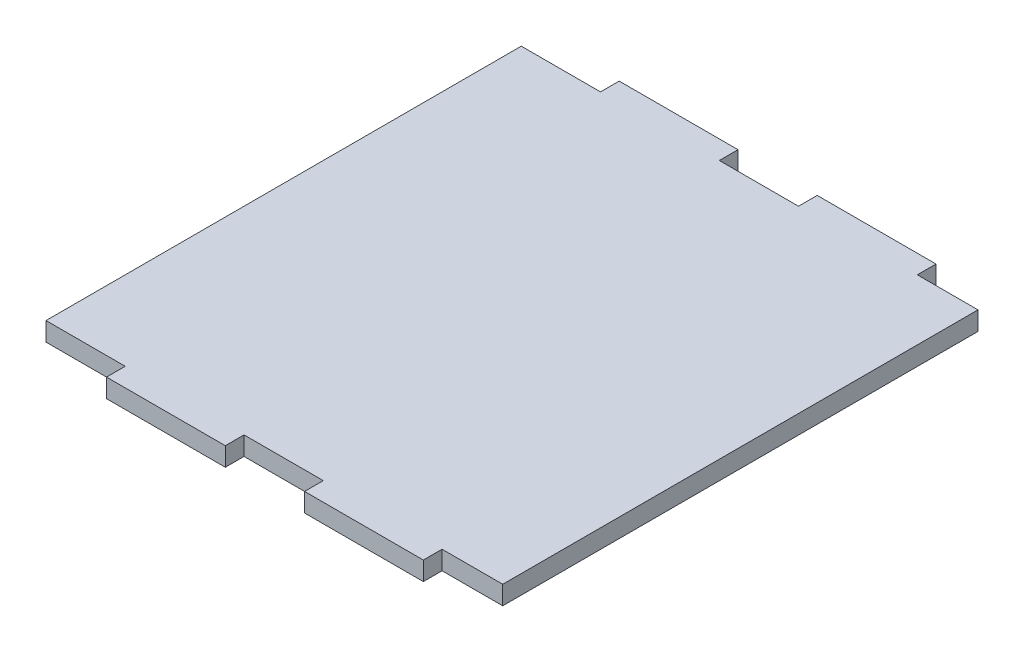
ISO-10303-21;
HEADER;
FILE_DESCRIPTION(('STEP AP214'),'2;1');
FILE_NAME('part.step','',(''),(''),'','','');
FILE_SCHEMA(('AUTOMOTIVE_DESIGN { 1 0 10303 214 1 1 1 1 }'));
ENDSEC;
DATA;
#1=APPLICATION_CONTEXT('core data for automotive mechanical design processes');
#2=APPLICATION_PROTOCOL_DEFINITION('international standard','automotive_design',2000,#1);
#3=PRODUCT_CONTEXT('',#1,'mechanical');
#4=PRODUCT('Part','Part','',(#3));
#5=PRODUCT_RELATED_PRODUCT_CATEGORY('part','',(#4));
#6=PRODUCT_DEFINITION_FORMATION('','',#4);
#7=PRODUCT_DEFINITION_CONTEXT('part definition',#1,'design');
#8=PRODUCT_DEFINITION('design','',#6,#7);
#9=PRODUCT_DEFINITION_SHAPE('','',#8);
#10=(LENGTH_UNIT() NAMED_UNIT(*) SI_UNIT(.MILLI.,.METRE.));
#11=(NAMED_UNIT(*) PLANE_ANGLE_UNIT() SI_UNIT($,.RADIAN.));
#12=(NAMED_UNIT(*) SI_UNIT($,.STERADIAN.) SOLID_ANGLE_UNIT());
#13=UNCERTAINTY_MEASURE_WITH_UNIT(LENGTH_MEASURE(1.E-05),#10,'distance_accuracy_value','');
#14=(GEOMETRIC_REPRESENTATION_CONTEXT(3) GLOBAL_UNCERTAINTY_ASSIGNED_CONTEXT((#13)) GLOBAL_UNIT_ASSIGNED_CONTEXT((#10,
#11,#12)) REPRESENTATION_CONTEXT('',''));
#15=CARTESIAN_POINT('',(0.,0.,0.));
#16=DIRECTION('',(0.,0.,1.));
#17=DIRECTION('',(1.,0.,0.));
#18=AXIS2_PLACEMENT_3D('',#15,#16,#17);
#19=CARTESIAN_POINT('',(25.4,3.,-38.1));
#20=DIRECTION('',(0.,0.,1.));
#21=DIRECTION('',(1.,0.,0.));
#22=AXIS2_PLACEMENT_3D('',#19,#20,#21);
#23=PLANE('',#22);
#24=DIRECTION('',(-1.,0.,0.));
#25=VECTOR('',#24,1.);
#26=CARTESIAN_POINT('',(25.4,0.,-38.1));
#27=LINE('',#26,#25);
#28=CARTESIAN_POINT('',(35.127525216624,0.,-38.1));
#29=VERTEX_POINT('',#28);
#30=CARTESIAN_POINT('',(25.4,0.,-38.1));
#31=VERTEX_POINT('',#30);
#32=EDGE_CURVE('E201',#29,#31,#27,.T.);
#33=ORIENTED_EDGE('',*,*,#32,.T.);
#34=DIRECTION('',(0.,-1.,0.));
#35=VECTOR('',#34,1.);
#36=CARTESIAN_POINT('',(25.4,3.,-38.1));
#37=LINE('',#36,#35);
#38=CARTESIAN_POINT('',(25.4,3.,-38.1));
#39=VERTEX_POINT('',#38);
#40=EDGE_CURVE('E11',#39,#31,#37,.T.);
#41=ORIENTED_EDGE('',*,*,#40,.F.);
#42=DIRECTION('',(-1.,0.,0.));
#43=VECTOR('',#42,1.);
#44=CARTESIAN_POINT('',(25.4,3.,-38.1));
#45=LINE('',#44,#43);
#46=CARTESIAN_POINT('',(35.127525216624,3.,-38.1));
#47=VERTEX_POINT('',#46);
#48=EDGE_CURVE('E239',#47,#39,#45,.T.);
#49=ORIENTED_EDGE('',*,*,#48,.F.);
#50=DIRECTION('',(0.,-1.,0.));
#51=VECTOR('',#50,1.);
#52=CARTESIAN_POINT('',(35.127525216624,3.,-38.1));
#53=LINE('',#52,#51);
#54=EDGE_CURVE('E197',#47,#29,#53,.T.);
#55=ORIENTED_EDGE('',*,*,#54,.T.);
#56=EDGE_LOOP('',(#33,#41,#49,#55));
#57=FACE_BOUND('',#56,.T.);
#58=ADVANCED_FACE('F33',(#57),#23,.F.);
#59=CARTESIAN_POINT('',(25.4,3.,-38.1));
#60=DIRECTION('',(-1.,0.,0.));
#61=DIRECTION('',(0.,0.,1.));
#62=AXIS2_PLACEMENT_3D('',#59,#60,#61);
#63=PLANE('',#62);
#64=DIRECTION('',(0.,0.,-1.));
#65=VECTOR('',#64,1.);
#66=CARTESIAN_POINT('',(25.4,0.,-38.1));
#67=LINE('',#66,#65);
#68=CARTESIAN_POINT('',(25.4,0.,-41.1));
#69=VERTEX_POINT('',#68);
#70=EDGE_CURVE('E204',#31,#69,#67,.T.);
#71=ORIENTED_EDGE('',*,*,#70,.T.);
#72=DIRECTION('',(0.,-1.,0.));
#73=VECTOR('',#72,1.);
#74=CARTESIAN_POINT('',(25.4,3.,-41.1));
#75=LINE('',#74,#73);
#76=CARTESIAN_POINT('',(25.4,3.,-41.1));
#77=VERTEX_POINT('',#76);
#78=EDGE_CURVE('E41',#77,#69,#75,.T.);
#79=ORIENTED_EDGE('',*,*,#78,.F.);
#80=DIRECTION('',(0.,0.,-1.));
#81=VECTOR('',#80,1.);
#82=CARTESIAN_POINT('',(25.4,3.,-38.1));
#83=LINE('',#82,#81);
#84=EDGE_CURVE('E128',#39,#77,#83,.T.);
#85=ORIENTED_EDGE('',*,*,#84,.F.);
#86=ORIENTED_EDGE('',*,*,#40,.T.);
#87=EDGE_LOOP('',(#71,#79,#85,#86));
#88=FACE_BOUND('',#87,.T.);
#89=ADVANCED_FACE('F357',(#88),#63,.F.);
#90=CARTESIAN_POINT('',(6.35,3.,-41.1));
#91=DIRECTION('',(0.,0.,1.));
#92=DIRECTION('',(1.,0.,0.));
#93=AXIS2_PLACEMENT_3D('',#90,#91,#92);
#94=PLANE('',#93);
#95=DIRECTION('',(-1.,0.,0.));
#96=VECTOR('',#95,1.);
#97=CARTESIAN_POINT('',(6.35,0.,-41.1));
#98=LINE('',#97,#96);
#99=CARTESIAN_POINT('',(6.35,0.,-41.1));
#100=VERTEX_POINT('',#99);
#101=EDGE_CURVE('E206',#69,#100,#98,.T.);
#102=ORIENTED_EDGE('',*,*,#101,.T.);
#103=DIRECTION('',(0.,-1.,0.));
#104=VECTOR('',#103,1.);
#105=CARTESIAN_POINT('',(6.35,3.,-41.1));
#106=LINE('',#105,#104);
#107=CARTESIAN_POINT('',(6.35,3.,-41.1));
#108=VERTEX_POINT('',#107);
#109=EDGE_CURVE('E282',#108,#100,#106,.T.);
#110=ORIENTED_EDGE('',*,*,#109,.F.);
#111=DIRECTION('',(-1.,0.,0.));
#112=VECTOR('',#111,1.);
#113=CARTESIAN_POINT('',(6.35,3.,-41.1));
#114=LINE('',#113,#112);
#115=EDGE_CURVE('E290',#77,#108,#114,.T.);
#116=ORIENTED_EDGE('',*,*,#115,.F.);
#117=ORIENTED_EDGE('',*,*,#78,.T.);
#118=EDGE_LOOP('',(#102,#110,#116,#117));
#119=FACE_BOUND('',#118,.T.);
#120=ADVANCED_FACE('F288',(#119),#94,.F.);
#121=CARTESIAN_POINT('',(6.35,3.,-38.1));
#122=DIRECTION('',(1.,0.,0.));
#123=DIRECTION('',(0.,0.,-1.));
#124=AXIS2_PLACEMENT_3D('',#121,#122,#123);
#125=PLANE('',#124);
#126=DIRECTION('',(0.,0.,1.));
#127=VECTOR('',#126,1.);
#128=CARTESIAN_POINT('',(6.35,0.,-38.1));
#129=LINE('',#128,#127);
#130=CARTESIAN_POINT('',(6.35,0.,-38.1));
#131=VERTEX_POINT('',#130);
#132=EDGE_CURVE('E208',#100,#131,#129,.T.);
#133=ORIENTED_EDGE('',*,*,#132,.T.);
#134=DIRECTION('',(0.,-1.,0.));
#135=VECTOR('',#134,1.);
#136=CARTESIAN_POINT('',(6.35,3.,-38.1));
#137=LINE('',#136,#135);
#138=CARTESIAN_POINT('',(6.35,3.,-38.1));
#139=VERTEX_POINT('',#138);
#140=EDGE_CURVE('E279',#139,#131,#137,.T.);
#141=ORIENTED_EDGE('',*,*,#140,.F.);
#142=DIRECTION('',(0.,0.,1.));
#143=VECTOR('',#142,1.);
#144=CARTESIAN_POINT('',(6.35,3.,-38.1));
#145=LINE('',#144,#143);
#146=EDGE_CURVE('E308',#108,#139,#145,.T.);
#147=ORIENTED_EDGE('',*,*,#146,.F.);
#148=ORIENTED_EDGE('',*,*,#109,.T.);
#149=EDGE_LOOP('',(#133,#141,#147,#148));
#150=FACE_BOUND('',#149,.T.);
#151=ADVANCED_FACE('F299',(#150),#125,.F.);
#152=CARTESIAN_POINT('',(-6.35,3.,-38.1));
#153=DIRECTION('',(0.,0.,1.));
#154=DIRECTION('',(1.,0.,0.));
#155=AXIS2_PLACEMENT_3D('',#152,#153,#154);
#156=PLANE('',#155);
#157=DIRECTION('',(-1.,0.,0.));
#158=VECTOR('',#157,1.);
#159=CARTESIAN_POINT('',(-6.35,0.,-38.1));
#160=LINE('',#159,#158);
#161=CARTESIAN_POINT('',(-6.35,0.,-38.1));
#162=VERTEX_POINT('',#161);
#163=EDGE_CURVE('E210',#131,#162,#160,.T.);
#164=ORIENTED_EDGE('',*,*,#163,.T.);
#165=DIRECTION('',(0.,-1.,0.));
#166=VECTOR('',#165,1.);
#167=CARTESIAN_POINT('',(-6.35,3.,-38.1));
#168=LINE('',#167,#166);
#169=CARTESIAN_POINT('',(-6.35,3.,-38.1));
#170=VERTEX_POINT('',#169);
#171=EDGE_CURVE('E276',#170,#162,#168,.T.);
#172=ORIENTED_EDGE('',*,*,#171,.F.);
#173=DIRECTION('',(-1.,0.,0.));
#174=VECTOR('',#173,1.);
#175=CARTESIAN_POINT('',(-6.35,3.,-38.1));
#176=LINE('',#175,#174);
#177=EDGE_CURVE('E305',#139,#170,#176,.T.);
#178=ORIENTED_EDGE('',*,*,#177,.F.);
#179=ORIENTED_EDGE('',*,*,#140,.T.);
#180=EDGE_LOOP('',(#164,#172,#178,#179));
#181=FACE_BOUND('',#180,.T.);
#182=ADVANCED_FACE('F303',(#181),#156,.F.);
#183=CARTESIAN_POINT('',(-6.35,3.,-38.1));
#184=DIRECTION('',(-1.,0.,0.));
#185=DIRECTION('',(0.,0.,1.));
#186=AXIS2_PLACEMENT_3D('',#183,#184,#185);
#187=PLANE('',#186);
#188=DIRECTION('',(0.,0.,-1.));
#189=VECTOR('',#188,1.);
#190=CARTESIAN_POINT('',(-6.35,0.,-38.1));
#191=LINE('',#190,#189);
#192=CARTESIAN_POINT('',(-6.35,0.,-41.1));
#193=VERTEX_POINT('',#192);
#194=EDGE_CURVE('E212',#162,#193,#191,.T.);
#195=ORIENTED_EDGE('',*,*,#194,.T.);
#196=DIRECTION('',(0.,-1.,0.));
#197=VECTOR('',#196,1.);
#198=CARTESIAN_POINT('',(-6.35,3.,-41.1));
#199=LINE('',#198,#197);
#200=CARTESIAN_POINT('',(-6.35,3.,-41.1));
#201=VERTEX_POINT('',#200);
#202=EDGE_CURVE('E273',#201,#193,#199,.T.);
#203=ORIENTED_EDGE('',*,*,#202,.F.);
#204=DIRECTION('',(0.,0.,-1.));
#205=VECTOR('',#204,1.);
#206=CARTESIAN_POINT('',(-6.35,3.,-38.1));
#207=LINE('',#206,#205);
#208=EDGE_CURVE('E307',#170,#201,#207,.T.);
#209=ORIENTED_EDGE('',*,*,#208,.F.);
#210=ORIENTED_EDGE('',*,*,#171,.T.);
#211=EDGE_LOOP('',(#195,#203,#209,#210));
#212=FACE_BOUND('',#211,.T.);
#213=ADVANCED_FACE('F370',(#212),#187,.F.);
#214=CARTESIAN_POINT('',(-25.4,3.,-41.1));
#215=DIRECTION('',(0.,0.,1.));
#216=DIRECTION('',(1.,0.,0.));
#217=AXIS2_PLACEMENT_3D('',#214,#215,#216);
#218=PLANE('',#217);
#219=DIRECTION('',(-1.,0.,0.));
#220=VECTOR('',#219,1.);
#221=CARTESIAN_POINT('',(-25.4,0.,-41.1));
#222=LINE('',#221,#220);
#223=CARTESIAN_POINT('',(-25.4,0.,-41.1));
#224=VERTEX_POINT('',#223);
#225=EDGE_CURVE('E214',#193,#224,#222,.T.);
#226=ORIENTED_EDGE('',*,*,#225,.T.);
#227=DIRECTION('',(0.,-1.,0.));
#228=VECTOR('',#227,1.);
#229=CARTESIAN_POINT('',(-25.4,3.,-41.1));
#230=LINE('',#229,#228);
#231=CARTESIAN_POINT('',(-25.4,3.,-41.1));
#232=VERTEX_POINT('',#231);
#233=EDGE_CURVE('E270',#232,#224,#230,.T.);
#234=ORIENTED_EDGE('',*,*,#233,.F.);
#235=DIRECTION('',(-1.,0.,0.));
#236=VECTOR('',#235,1.);
#237=CARTESIAN_POINT('',(-25.4,3.,-41.1));
#238=LINE('',#237,#236);
#239=EDGE_CURVE('E310',#201,#232,#238,.T.);
#240=ORIENTED_EDGE('',*,*,#239,.F.);
#241=ORIENTED_EDGE('',*,*,#202,.T.);
#242=EDGE_LOOP('',(#226,#234,#240,#241));
#243=FACE_BOUND('',#242,.T.);
#244=ADVANCED_FACE('F373',(#243),#218,.F.);
#245=CARTESIAN_POINT('',(-25.4,3.,-38.1));
#246=DIRECTION('',(1.,0.,0.));
#247=DIRECTION('',(0.,0.,-1.));
#248=AXIS2_PLACEMENT_3D('',#245,#246,#247);
#249=PLANE('',#248);
#250=DIRECTION('',(0.,0.,1.));
#251=VECTOR('',#250,1.);
#252=CARTESIAN_POINT('',(-25.4,0.,-38.1));
#253=LINE('',#252,#251);
#254=CARTESIAN_POINT('',(-25.4,0.,-38.1));
#255=VERTEX_POINT('',#254);
#256=EDGE_CURVE('E216',#224,#255,#253,.T.);
#257=ORIENTED_EDGE('',*,*,#256,.T.);
#258=DIRECTION('',(0.,-1.,0.));
#259=VECTOR('',#258,1.);
#260=CARTESIAN_POINT('',(-25.4,3.,-38.1));
#261=LINE('',#260,#259);
#262=CARTESIAN_POINT('',(-25.4,3.,-38.1));
#263=VERTEX_POINT('',#262);
#264=EDGE_CURVE('E267',#263,#255,#261,.T.);
#265=ORIENTED_EDGE('',*,*,#264,.F.);
#266=DIRECTION('',(0.,0.,1.));
#267=VECTOR('',#266,1.);
#268=CARTESIAN_POINT('',(-25.4,3.,-38.1));
#269=LINE('',#268,#267);
#270=EDGE_CURVE('E316',#232,#263,#269,.T.);
#271=ORIENTED_EDGE('',*,*,#270,.F.);
#272=ORIENTED_EDGE('',*,*,#233,.T.);
#273=EDGE_LOOP('',(#257,#265,#271,#272));
#274=FACE_BOUND('',#273,.T.);
#275=ADVANCED_FACE('F377',(#274),#249,.F.);
#276=CARTESIAN_POINT('',(-38.1,3.,-38.1));
#277=DIRECTION('',(0.,0.,1.));
#278=DIRECTION('',(1.,0.,0.));
#279=AXIS2_PLACEMENT_3D('',#276,#277,#278);
#280=PLANE('',#279);
#281=DIRECTION('',(-1.,0.,0.));
#282=VECTOR('',#281,1.);
#283=CARTESIAN_POINT('',(-38.1,0.,-38.1));
#284=LINE('',#283,#282);
#285=CARTESIAN_POINT('',(-38.1,0.,-38.1));
#286=VERTEX_POINT('',#285);
#287=EDGE_CURVE('E218',#255,#286,#284,.T.);
#288=ORIENTED_EDGE('',*,*,#287,.T.);
#289=DIRECTION('',(0.,-1.,0.));
#290=VECTOR('',#289,1.);
#291=CARTESIAN_POINT('',(-38.1,3.,-38.1));
#292=LINE('',#291,#290);
#293=CARTESIAN_POINT('',(-38.1,3.,-38.1));
#294=VERTEX_POINT('',#293);
#295=EDGE_CURVE('E264',#294,#286,#292,.T.);
#296=ORIENTED_EDGE('',*,*,#295,.F.);
#297=DIRECTION('',(-1.,0.,0.));
#298=VECTOR('',#297,1.);
#299=CARTESIAN_POINT('',(-38.1,3.,-38.1));
#300=LINE('',#299,#298);
#301=EDGE_CURVE('E318',#263,#294,#300,.T.);
#302=ORIENTED_EDGE('',*,*,#301,.F.);
#303=ORIENTED_EDGE('',*,*,#264,.T.);
#304=EDGE_LOOP('',(#288,#296,#302,#303));
#305=FACE_BOUND('',#304,.T.);
#306=ADVANCED_FACE('F381',(#305),#280,.F.);
#307=CARTESIAN_POINT('',(-38.1,3.,-38.1));
#308=DIRECTION('',(1.,0.,0.));
#309=DIRECTION('',(0.,0.,-1.));
#310=AXIS2_PLACEMENT_3D('',#307,#308,#309);
#311=PLANE('',#310);
#312=DIRECTION('',(0.,0.,1.));
#313=VECTOR('',#312,1.);
#314=CARTESIAN_POINT('',(-38.1,0.,-38.1));
#315=LINE('',#314,#313);
#316=CARTESIAN_POINT('',(-38.1,0.,38.1));
#317=VERTEX_POINT('',#316);
#318=EDGE_CURVE('E220',#286,#317,#315,.T.);
#319=ORIENTED_EDGE('',*,*,#318,.T.);
#320=DIRECTION('',(0.,-1.,0.));
#321=VECTOR('',#320,1.);
#322=CARTESIAN_POINT('',(-38.1,3.,38.1));
#323=LINE('',#322,#321);
#324=CARTESIAN_POINT('',(-38.1,3.,38.1));
#325=VERTEX_POINT('',#324);
#326=EDGE_CURVE('E261',#325,#317,#323,.T.);
#327=ORIENTED_EDGE('',*,*,#326,.F.);
#328=DIRECTION('',(0.,0.,1.));
#329=VECTOR('',#328,1.);
#330=CARTESIAN_POINT('',(-38.1,3.,-38.1));
#331=LINE('',#330,#329);
#332=EDGE_CURVE('E320',#294,#325,#331,.T.);
#333=ORIENTED_EDGE('',*,*,#332,.F.);
#334=ORIENTED_EDGE('',*,*,#295,.T.);
#335=EDGE_LOOP('',(#319,#327,#333,#334));
#336=FACE_BOUND('',#335,.T.);
#337=ADVANCED_FACE('F385',(#336),#311,.F.);
#338=CARTESIAN_POINT('',(-38.1,3.,38.1));
#339=DIRECTION('',(0.,0.,-1.));
#340=DIRECTION('',(-1.,0.,0.));
#341=AXIS2_PLACEMENT_3D('',#338,#339,#340);
#342=PLANE('',#341);
#343=DIRECTION('',(1.,0.,0.));
#344=VECTOR('',#343,1.);
#345=CARTESIAN_POINT('',(-38.1,0.,38.1));
#346=LINE('',#345,#344);
#347=CARTESIAN_POINT('',(-25.4,0.,38.1));
#348=VERTEX_POINT('',#347);
#349=EDGE_CURVE('E222',#317,#348,#346,.T.);
#350=ORIENTED_EDGE('',*,*,#349,.T.);
#351=DIRECTION('',(0.,-1.,0.));
#352=VECTOR('',#351,1.);
#353=CARTESIAN_POINT('',(-25.4,3.,38.1));
#354=LINE('',#353,#352);
#355=CARTESIAN_POINT('',(-25.4,3.,38.1));
#356=VERTEX_POINT('',#355);
#357=EDGE_CURVE('E258',#356,#348,#354,.T.);
#358=ORIENTED_EDGE('',*,*,#357,.F.);
#359=DIRECTION('',(1.,0.,0.));
#360=VECTOR('',#359,1.);
#361=CARTESIAN_POINT('',(-38.1,3.,38.1));
#362=LINE('',#361,#360);
#363=EDGE_CURVE('E322',#325,#356,#362,.T.);
#364=ORIENTED_EDGE('',*,*,#363,.F.);
#365=ORIENTED_EDGE('',*,*,#326,.T.);
#366=EDGE_LOOP('',(#350,#358,#364,#365));
#367=FACE_BOUND('',#366,.T.);
#368=ADVANCED_FACE('F389',(#367),#342,.F.);
#369=CARTESIAN_POINT('',(-25.4,3.,38.1));
#370=DIRECTION('',(1.,0.,0.));
#371=DIRECTION('',(0.,0.,-1.));
#372=AXIS2_PLACEMENT_3D('',#369,#370,#371);
#373=PLANE('',#372);
#374=DIRECTION('',(0.,0.,1.));
#375=VECTOR('',#374,1.);
#376=CARTESIAN_POINT('',(-25.4,0.,38.1));
#377=LINE('',#376,#375);
#378=CARTESIAN_POINT('',(-25.4,0.,41.1));
#379=VERTEX_POINT('',#378);
#380=EDGE_CURVE('E224',#348,#379,#377,.T.);
#381=ORIENTED_EDGE('',*,*,#380,.T.);
#382=DIRECTION('',(0.,-1.,0.));
#383=VECTOR('',#382,1.);
#384=CARTESIAN_POINT('',(-25.4,3.,41.1));
#385=LINE('',#384,#383);
#386=CARTESIAN_POINT('',(-25.4,3.,41.1));
#387=VERTEX_POINT('',#386);
#388=EDGE_CURVE('E255',#387,#379,#385,.T.);
#389=ORIENTED_EDGE('',*,*,#388,.F.);
#390=DIRECTION('',(0.,0.,1.));
#391=VECTOR('',#390,1.);
#392=CARTESIAN_POINT('',(-25.4,3.,38.1));
#393=LINE('',#392,#391);
#394=EDGE_CURVE('E324',#356,#387,#393,.T.);
#395=ORIENTED_EDGE('',*,*,#394,.F.);
#396=ORIENTED_EDGE('',*,*,#357,.T.);
#397=EDGE_LOOP('',(#381,#389,#395,#396));
#398=FACE_BOUND('',#397,.T.);
#399=ADVANCED_FACE('F393',(#398),#373,.F.);
#400=CARTESIAN_POINT('',(-25.4,3.,41.1));
#401=DIRECTION('',(0.,0.,-1.));
#402=DIRECTION('',(-1.,0.,0.));
#403=AXIS2_PLACEMENT_3D('',#400,#401,#402);
#404=PLANE('',#403);
#405=DIRECTION('',(1.,0.,0.));
#406=VECTOR('',#405,1.);
#407=CARTESIAN_POINT('',(-25.4,0.,41.1));
#408=LINE('',#407,#406);
#409=CARTESIAN_POINT('',(-6.35,0.,41.1));
#410=VERTEX_POINT('',#409);
#411=EDGE_CURVE('E226',#379,#410,#408,.T.);
#412=ORIENTED_EDGE('',*,*,#411,.T.);
#413=DIRECTION('',(0.,-1.,0.));
#414=VECTOR('',#413,1.);
#415=CARTESIAN_POINT('',(-6.35,3.,41.1));
#416=LINE('',#415,#414);
#417=CARTESIAN_POINT('',(-6.35,3.,41.1));
#418=VERTEX_POINT('',#417);
#419=EDGE_CURVE('E252',#418,#410,#416,.T.);
#420=ORIENTED_EDGE('',*,*,#419,.F.);
#421=DIRECTION('',(1.,0.,0.));
#422=VECTOR('',#421,1.);
#423=CARTESIAN_POINT('',(-25.4,3.,41.1));
#424=LINE('',#423,#422);
#425=EDGE_CURVE('E326',#387,#418,#424,.T.);
#426=ORIENTED_EDGE('',*,*,#425,.F.);
#427=ORIENTED_EDGE('',*,*,#388,.T.);
#428=EDGE_LOOP('',(#412,#420,#426,#427));
#429=FACE_BOUND('',#428,.T.);
#430=ADVANCED_FACE('F397',(#429),#404,.F.);
#431=CARTESIAN_POINT('',(-6.35,3.,38.1));
#432=DIRECTION('',(-1.,0.,0.));
#433=DIRECTION('',(0.,0.,1.));
#434=AXIS2_PLACEMENT_3D('',#431,#432,#433);
#435=PLANE('',#434);
#436=DIRECTION('',(0.,0.,-1.));
#437=VECTOR('',#436,1.);
#438=CARTESIAN_POINT('',(-6.35,0.,38.1));
#439=LINE('',#438,#437);
#440=CARTESIAN_POINT('',(-6.35,0.,38.1));
#441=VERTEX_POINT('',#440);
#442=EDGE_CURVE('E228',#410,#441,#439,.T.);
#443=ORIENTED_EDGE('',*,*,#442,.T.);
#444=DIRECTION('',(0.,-1.,0.));
#445=VECTOR('',#444,1.);
#446=CARTESIAN_POINT('',(-6.35,3.,38.1));
#447=LINE('',#446,#445);
#448=CARTESIAN_POINT('',(-6.35,3.,38.1));
#449=VERTEX_POINT('',#448);
#450=EDGE_CURVE('E249',#449,#441,#447,.T.);
#451=ORIENTED_EDGE('',*,*,#450,.F.);
#452=DIRECTION('',(0.,0.,-1.));
#453=VECTOR('',#452,1.);
#454=CARTESIAN_POINT('',(-6.35,3.,38.1));
#455=LINE('',#454,#453);
#456=EDGE_CURVE('E328',#418,#449,#455,.T.);
#457=ORIENTED_EDGE('',*,*,#456,.F.);
#458=ORIENTED_EDGE('',*,*,#419,.T.);
#459=EDGE_LOOP('',(#443,#451,#457,#458));
#460=FACE_BOUND('',#459,.T.);
#461=ADVANCED_FACE('F401',(#460),#435,.F.);
#462=CARTESIAN_POINT('',(-6.35,3.,38.1));
#463=DIRECTION('',(0.,0.,-1.));
#464=DIRECTION('',(-1.,0.,0.));
#465=AXIS2_PLACEMENT_3D('',#462,#463,#464);
#466=PLANE('',#465);
#467=DIRECTION('',(1.,0.,0.));
#468=VECTOR('',#467,1.);
#469=CARTESIAN_POINT('',(-6.35,0.,38.1));
#470=LINE('',#469,#468);
#471=CARTESIAN_POINT('',(6.35,0.,38.1));
#472=VERTEX_POINT('',#471);
#473=EDGE_CURVE('E230',#441,#472,#470,.T.);
#474=ORIENTED_EDGE('',*,*,#473,.T.);
#475=DIRECTION('',(0.,-1.,0.));
#476=VECTOR('',#475,1.);
#477=CARTESIAN_POINT('',(6.35,3.,38.1));
#478=LINE('',#477,#476);
#479=CARTESIAN_POINT('',(6.35,3.,38.1));
#480=VERTEX_POINT('',#479);
#481=EDGE_CURVE('E246',#480,#472,#478,.T.);
#482=ORIENTED_EDGE('',*,*,#481,.F.);
#483=DIRECTION('',(1.,0.,0.));
#484=VECTOR('',#483,1.);
#485=CARTESIAN_POINT('',(-6.35,3.,38.1));
#486=LINE('',#485,#484);
#487=EDGE_CURVE('E330',#449,#480,#486,.T.);
#488=ORIENTED_EDGE('',*,*,#487,.F.);
#489=ORIENTED_EDGE('',*,*,#450,.T.);
#490=EDGE_LOOP('',(#474,#482,#488,#489));
#491=FACE_BOUND('',#490,.T.);
#492=ADVANCED_FACE('F405',(#491),#466,.F.);
#493=CARTESIAN_POINT('',(6.35,3.,38.1));
#494=DIRECTION('',(1.,0.,0.));
#495=DIRECTION('',(0.,0.,-1.));
#496=AXIS2_PLACEMENT_3D('',#493,#494,#495);
#497=PLANE('',#496);
#498=DIRECTION('',(0.,0.,1.));
#499=VECTOR('',#498,1.);
#500=CARTESIAN_POINT('',(6.35,0.,38.1));
#501=LINE('',#500,#499);
#502=CARTESIAN_POINT('',(6.35,0.,41.1));
#503=VERTEX_POINT('',#502);
#504=EDGE_CURVE('E232',#472,#503,#501,.T.);
#505=ORIENTED_EDGE('',*,*,#504,.T.);
#506=DIRECTION('',(0.,-1.,0.));
#507=VECTOR('',#506,1.);
#508=CARTESIAN_POINT('',(6.35,3.,41.1));
#509=LINE('',#508,#507);
#510=CARTESIAN_POINT('',(6.35,3.,41.1));
#511=VERTEX_POINT('',#510);
#512=EDGE_CURVE('E243',#511,#503,#509,.T.);
#513=ORIENTED_EDGE('',*,*,#512,.F.);
#514=DIRECTION('',(0.,0.,1.));
#515=VECTOR('',#514,1.);
#516=CARTESIAN_POINT('',(6.35,3.,38.1));
#517=LINE('',#516,#515);
#518=EDGE_CURVE('E332',#480,#511,#517,.T.);
#519=ORIENTED_EDGE('',*,*,#518,.F.);
#520=ORIENTED_EDGE('',*,*,#481,.T.);
#521=EDGE_LOOP('',(#505,#513,#519,#520));
#522=FACE_BOUND('',#521,.T.);
#523=ADVANCED_FACE('F338',(#522),#497,.F.);
#524=CARTESIAN_POINT('',(6.35,3.,41.1));
#525=DIRECTION('',(0.,0.,-1.));
#526=DIRECTION('',(-1.,0.,0.));
#527=AXIS2_PLACEMENT_3D('',#524,#525,#526);
#528=PLANE('',#527);
#529=DIRECTION('',(1.,0.,0.));
#530=VECTOR('',#529,1.);
#531=CARTESIAN_POINT('',(6.35,0.,41.1));
#532=LINE('',#531,#530);
#533=CARTESIAN_POINT('',(25.4,0.,41.1));
#534=VERTEX_POINT('',#533);
#535=EDGE_CURVE('E234',#503,#534,#532,.T.);
#536=ORIENTED_EDGE('',*,*,#535,.T.);
#537=DIRECTION('',(0.,-1.,0.));
#538=VECTOR('',#537,1.);
#539=CARTESIAN_POINT('',(25.4,3.,41.1));
#540=LINE('',#539,#538);
#541=CARTESIAN_POINT('',(25.4,3.,41.1));
#542=VERTEX_POINT('',#541);
#543=EDGE_CURVE('E192',#542,#534,#540,.T.);
#544=ORIENTED_EDGE('',*,*,#543,.F.);
#545=DIRECTION('',(1.,0.,0.));
#546=VECTOR('',#545,1.);
#547=CARTESIAN_POINT('',(6.35,3.,41.1));
#548=LINE('',#547,#546);
#549=EDGE_CURVE('E183',#511,#542,#548,.T.);
#550=ORIENTED_EDGE('',*,*,#549,.F.);
#551=ORIENTED_EDGE('',*,*,#512,.T.);
#552=EDGE_LOOP('',(#536,#544,#550,#551));
#553=FACE_BOUND('',#552,.T.);
#554=ADVANCED_FACE('F342',(#553),#528,.F.);
#555=CARTESIAN_POINT('',(25.4,3.,38.1));
#556=DIRECTION('',(-1.,0.,0.));
#557=DIRECTION('',(0.,0.,1.));
#558=AXIS2_PLACEMENT_3D('',#555,#556,#557);
#559=PLANE('',#558);
#560=DIRECTION('',(0.,0.,-1.));
#561=VECTOR('',#560,1.);
#562=CARTESIAN_POINT('',(25.4,0.,38.1));
#563=LINE('',#562,#561);
#564=CARTESIAN_POINT('',(25.4,0.,38.1));
#565=VERTEX_POINT('',#564);
#566=EDGE_CURVE('E191',#534,#565,#563,.T.);
#567=ORIENTED_EDGE('',*,*,#566,.T.);
#568=DIRECTION('',(0.,-1.,0.));
#569=VECTOR('',#568,1.);
#570=CARTESIAN_POINT('',(25.4,3.,38.1));
#571=LINE('',#570,#569);
#572=CARTESIAN_POINT('',(25.4,3.,38.1));
#573=VERTEX_POINT('',#572);
#574=EDGE_CURVE('E188',#573,#565,#571,.T.);
#575=ORIENTED_EDGE('',*,*,#574,.F.);
#576=DIRECTION('',(0.,0.,-1.));
#577=VECTOR('',#576,1.);
#578=CARTESIAN_POINT('',(25.4,3.,38.1));
#579=LINE('',#578,#577);
#580=EDGE_CURVE('E177',#542,#573,#579,.T.);
#581=ORIENTED_EDGE('',*,*,#580,.F.);
#582=ORIENTED_EDGE('',*,*,#543,.T.);
#583=EDGE_LOOP('',(#567,#575,#581,#582));
#584=FACE_BOUND('',#583,.T.);
#585=ADVANCED_FACE('F189',(#584),#559,.F.);
#586=CARTESIAN_POINT('',(25.4,3.,38.1));
#587=DIRECTION('',(0.,0.,-1.));
#588=DIRECTION('',(-1.,0.,0.));
#589=AXIS2_PLACEMENT_3D('',#586,#587,#588);
#590=PLANE('',#589);
#591=DIRECTION('',(1.,0.,0.));
#592=VECTOR('',#591,1.);
#593=CARTESIAN_POINT('',(25.4,0.,38.1));
#594=LINE('',#593,#592);
#595=CARTESIAN_POINT('',(35.127525216624,0.,38.1));
#596=VERTEX_POINT('',#595);
#597=EDGE_CURVE('E114',#565,#596,#594,.T.);
#598=ORIENTED_EDGE('',*,*,#597,.T.);
#599=DIRECTION('',(0.,-1.,0.));
#600=VECTOR('',#599,1.);
#601=CARTESIAN_POINT('',(35.127525216624,3.,38.1));
#602=LINE('',#601,#600);
#603=CARTESIAN_POINT('',(35.127525216624,3.,38.1));
#604=VERTEX_POINT('',#603);
#605=EDGE_CURVE('E193',#604,#596,#602,.T.);
#606=ORIENTED_EDGE('',*,*,#605,.F.);
#607=DIRECTION('',(1.,0.,0.));
#608=VECTOR('',#607,1.);
#609=CARTESIAN_POINT('',(25.4,3.,38.1));
#610=LINE('',#609,#608);
#611=EDGE_CURVE('E181',#573,#604,#610,.T.);
#612=ORIENTED_EDGE('',*,*,#611,.F.);
#613=ORIENTED_EDGE('',*,*,#574,.T.);
#614=EDGE_LOOP('',(#598,#606,#612,#613));
#615=FACE_BOUND('',#614,.T.);
#616=ADVANCED_FACE('F195',(#615),#590,.F.);
#617=CARTESIAN_POINT('',(35.127525216624,3.,-38.1));
#618=DIRECTION('',(-1.,0.,0.));
#619=DIRECTION('',(0.,0.,1.));
#620=AXIS2_PLACEMENT_3D('',#617,#618,#619);
#621=PLANE('',#620);
#622=DIRECTION('',(0.,0.,-1.));
#623=VECTOR('',#622,1.);
#624=CARTESIAN_POINT('',(35.127525216624,0.,-38.1));
#625=LINE('',#624,#623);
#626=EDGE_CURVE('E120',#596,#29,#625,.T.);
#627=ORIENTED_EDGE('',*,*,#626,.T.);
#628=ORIENTED_EDGE('',*,*,#54,.F.);
#629=DIRECTION('',(0.,0.,-1.));
#630=VECTOR('',#629,1.);
#631=CARTESIAN_POINT('',(35.127525216624,3.,-38.1));
#632=LINE('',#631,#630);
#633=EDGE_CURVE('E49',#604,#47,#632,.T.);
#634=ORIENTED_EDGE('',*,*,#633,.F.);
#635=ORIENTED_EDGE('',*,*,#605,.T.);
#636=EDGE_LOOP('',(#627,#628,#634,#635));
#637=FACE_BOUND('',#636,.T.);
#638=ADVANCED_FACE('F346',(#637),#621,.F.);
#639=CARTESIAN_POINT('',(0.,3.,0.));
#640=DIRECTION('',(0.,-1.,0.));
#641=DIRECTION('',(0.,0.,-1.));
#642=AXIS2_PLACEMENT_3D('',#639,#640,#641);
#643=PLANE('',#642);
#644=ORIENTED_EDGE('',*,*,#48,.T.);
#645=ORIENTED_EDGE('',*,*,#84,.T.);
#646=ORIENTED_EDGE('',*,*,#115,.T.);
#647=ORIENTED_EDGE('',*,*,#146,.T.);
#648=ORIENTED_EDGE('',*,*,#177,.T.);
#649=ORIENTED_EDGE('',*,*,#208,.T.);
#650=ORIENTED_EDGE('',*,*,#239,.T.);
#651=ORIENTED_EDGE('',*,*,#270,.T.);
#652=ORIENTED_EDGE('',*,*,#301,.T.);
#653=ORIENTED_EDGE('',*,*,#332,.T.);
#654=ORIENTED_EDGE('',*,*,#363,.T.);
#655=ORIENTED_EDGE('',*,*,#394,.T.);
#656=ORIENTED_EDGE('',*,*,#425,.T.);
#657=ORIENTED_EDGE('',*,*,#456,.T.);
#658=ORIENTED_EDGE('',*,*,#487,.T.);
#659=ORIENTED_EDGE('',*,*,#518,.T.);
#660=ORIENTED_EDGE('',*,*,#549,.T.);
#661=ORIENTED_EDGE('',*,*,#580,.T.);
#662=ORIENTED_EDGE('',*,*,#611,.T.);
#663=ORIENTED_EDGE('',*,*,#633,.T.);
#664=EDGE_LOOP('',(#644,#645,#646,#647,#648,#649,#650,#651,#652,#653,#654,#655,#656,#657,#658,
#659,#660,#661,#662,#663));
#665=FACE_BOUND('',#664,.T.);
#666=ADVANCED_FACE('F179',(#665),#643,.F.);
#667=CARTESIAN_POINT('',(0.,0.,0.));
#668=DIRECTION('',(0.,-1.,0.));
#669=DIRECTION('',(0.,0.,-1.));
#670=AXIS2_PLACEMENT_3D('',#667,#668,#669);
#671=PLANE('',#670);
#672=ORIENTED_EDGE('',*,*,#32,.F.);
#673=ORIENTED_EDGE('',*,*,#626,.F.);
#674=ORIENTED_EDGE('',*,*,#597,.F.);
#675=ORIENTED_EDGE('',*,*,#566,.F.);
#676=ORIENTED_EDGE('',*,*,#535,.F.);
#677=ORIENTED_EDGE('',*,*,#504,.F.);
#678=ORIENTED_EDGE('',*,*,#473,.F.);
#679=ORIENTED_EDGE('',*,*,#442,.F.);
#680=ORIENTED_EDGE('',*,*,#411,.F.);
#681=ORIENTED_EDGE('',*,*,#380,.F.);
#682=ORIENTED_EDGE('',*,*,#349,.F.);
#683=ORIENTED_EDGE('',*,*,#318,.F.);
#684=ORIENTED_EDGE('',*,*,#287,.F.);
#685=ORIENTED_EDGE('',*,*,#256,.F.);
#686=ORIENTED_EDGE('',*,*,#225,.F.);
#687=ORIENTED_EDGE('',*,*,#194,.F.);
#688=ORIENTED_EDGE('',*,*,#163,.F.);
#689=ORIENTED_EDGE('',*,*,#132,.F.);
#690=ORIENTED_EDGE('',*,*,#101,.F.);
#691=ORIENTED_EDGE('',*,*,#70,.F.);
#692=EDGE_LOOP('',(#672,#673,#674,#675,#676,#677,#678,#679,#680,#681,#682,#683,#684,#685,#686,
#687,#688,#689,#690,#691));
#693=FACE_BOUND('',#692,.T.);
#694=ADVANCED_FACE('F294',(#693),#671,.T.);
#695=CLOSED_SHELL('',(#58,#89,#120,#151,#182,#213,#244,#275,#306,#337,#368,#399,#430,#461,#492,
#523,#554,#585,#616,#638,#666,#694));
#696=MANIFOLD_SOLID_BREP('B2',#695);
#697=ADVANCED_BREP_SHAPE_REPRESENTATION('',(#18,#696),#14);
#698=SHAPE_DEFINITION_REPRESENTATION(#9,#697);
ENDSEC;
END-ISO-10303-21;
